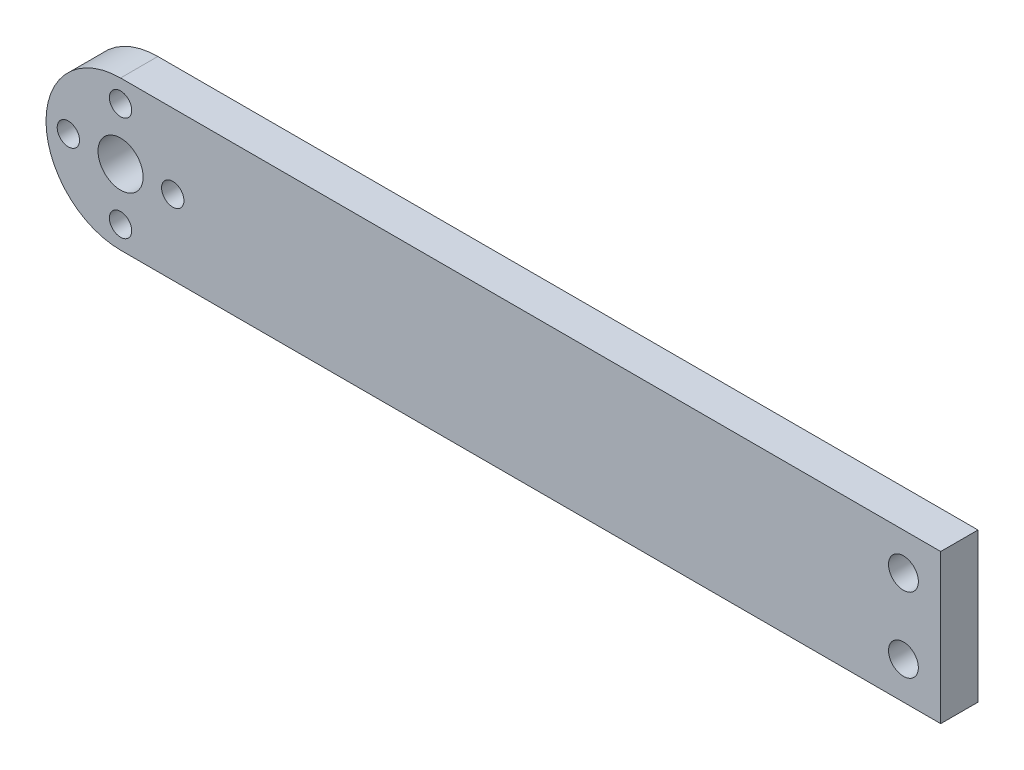
ISO-10303-21;
HEADER;
FILE_DESCRIPTION(('STEP AP214'),'2;1');
FILE_NAME('part.step','',(''),(''),'','','');
FILE_SCHEMA(('AUTOMOTIVE_DESIGN { 1 0 10303 214 1 1 1 1 }'));
ENDSEC;
DATA;
#1=APPLICATION_CONTEXT('core data for automotive mechanical design processes');
#2=APPLICATION_PROTOCOL_DEFINITION('international standard','automotive_design',2000,#1);
#3=PRODUCT_CONTEXT('',#1,'mechanical');
#4=PRODUCT('Part','Part','',(#3));
#5=PRODUCT_RELATED_PRODUCT_CATEGORY('part','',(#4));
#6=PRODUCT_DEFINITION_FORMATION('','',#4);
#7=PRODUCT_DEFINITION_CONTEXT('part definition',#1,'design');
#8=PRODUCT_DEFINITION('design','',#6,#7);
#9=PRODUCT_DEFINITION_SHAPE('','',#8);
#10=(LENGTH_UNIT() NAMED_UNIT(*) SI_UNIT(.MILLI.,.METRE.));
#11=(NAMED_UNIT(*) PLANE_ANGLE_UNIT() SI_UNIT($,.RADIAN.));
#12=(NAMED_UNIT(*) SI_UNIT($,.STERADIAN.) SOLID_ANGLE_UNIT());
#13=UNCERTAINTY_MEASURE_WITH_UNIT(LENGTH_MEASURE(1.E-05),#10,'distance_accuracy_value','');
#14=(GEOMETRIC_REPRESENTATION_CONTEXT(3) GLOBAL_UNCERTAINTY_ASSIGNED_CONTEXT((#13)) GLOBAL_UNIT_ASSIGNED_CONTEXT((#10,
#11,#12)) REPRESENTATION_CONTEXT('',''));
#15=CARTESIAN_POINT('',(0.,0.,0.));
#16=DIRECTION('',(0.,0.,1.));
#17=DIRECTION('',(1.,0.,0.));
#18=AXIS2_PLACEMENT_3D('',#15,#16,#17);
#19=CARTESIAN_POINT('',(0.,20.,5.));
#20=DIRECTION('',(0.,-1.,0.));
#21=DIRECTION('',(0.,0.,-1.));
#22=AXIS2_PLACEMENT_3D('',#19,#20,#21);
#23=PLANE('',#22);
#24=DIRECTION('',(0.,0.,1.));
#25=VECTOR('',#24,1.);
#26=CARTESIAN_POINT('',(10.,20.,-5.));
#27=LINE('',#26,#25);
#28=CARTESIAN_POINT('',(10.,20.,0.));
#29=VERTEX_POINT('',#28);
#30=CARTESIAN_POINT('',(10.,20.,5.));
#31=VERTEX_POINT('',#30);
#32=EDGE_CURVE('E85',#29,#31,#27,.T.);
#33=ORIENTED_EDGE('',*,*,#32,.T.);
#34=DIRECTION('',(-1.,0.,0.));
#35=VECTOR('',#34,1.);
#36=CARTESIAN_POINT('',(0.,20.,5.));
#37=LINE('',#36,#35);
#38=CARTESIAN_POINT('',(120.,20.,5.));
#39=VERTEX_POINT('',#38);
#40=EDGE_CURVE('E90',#39,#31,#37,.T.);
#41=ORIENTED_EDGE('',*,*,#40,.F.);
#42=DIRECTION('',(0.,0.,-1.));
#43=VECTOR('',#42,1.);
#44=CARTESIAN_POINT('',(120.,20.,5.));
#45=LINE('',#44,#43);
#46=CARTESIAN_POINT('',(120.,20.,0.));
#47=VERTEX_POINT('',#46);
#48=EDGE_CURVE('E104',#39,#47,#45,.T.);
#49=ORIENTED_EDGE('',*,*,#48,.T.);
#50=DIRECTION('',(-1.,0.,0.));
#51=VECTOR('',#50,1.);
#52=CARTESIAN_POINT('',(0.,20.,0.));
#53=LINE('',#52,#51);
#54=EDGE_CURVE('E93',#47,#29,#53,.T.);
#55=ORIENTED_EDGE('',*,*,#54,.T.);
#56=EDGE_LOOP('',(#33,#41,#49,#55));
#57=FACE_BOUND('',#56,.T.);
#58=ADVANCED_FACE('F33',(#57),#23,.F.);
#59=CARTESIAN_POINT('',(0.,0.,5.));
#60=DIRECTION('',(0.,0.,-1.));
#61=DIRECTION('',(-1.,0.,0.));
#62=AXIS2_PLACEMENT_3D('',#59,#60,#61);
#63=PLANE('',#62);
#64=CARTESIAN_POINT('',(115.,5.,5.));
#65=DIRECTION('',(0.,0.,1.));
#66=DIRECTION('',(1.,0.,0.));
#67=AXIS2_PLACEMENT_3D('',#64,#65,#66);
#68=CIRCLE('',#67,2.);
#69=CARTESIAN_POINT('',(117.,5.,5.));
#70=VERTEX_POINT('',#69);
#71=EDGE_CURVE('E134',#70,#70,#68,.T.);
#72=ORIENTED_EDGE('',*,*,#71,.F.);
#73=EDGE_LOOP('',(#72));
#74=FACE_BOUND('',#73,.T.);
#75=CARTESIAN_POINT('',(115.,15.,5.));
#76=DIRECTION('',(0.,0.,1.));
#77=DIRECTION('',(1.,0.,0.));
#78=AXIS2_PLACEMENT_3D('',#75,#76,#77);
#79=CIRCLE('',#78,2.);
#80=CARTESIAN_POINT('',(117.,15.,5.));
#81=VERTEX_POINT('',#80);
#82=EDGE_CURVE('E126',#81,#81,#79,.T.);
#83=ORIENTED_EDGE('',*,*,#82,.F.);
#84=EDGE_LOOP('',(#83));
#85=FACE_BOUND('',#84,.T.);
#86=CARTESIAN_POINT('',(10.,3.,5.));
#87=DIRECTION('',(0.,0.,1.));
#88=DIRECTION('',(1.,0.,0.));
#89=AXIS2_PLACEMENT_3D('',#86,#87,#88);
#90=CIRCLE('',#89,1.5);
#91=CARTESIAN_POINT('',(11.5,3.,5.));
#92=VERTEX_POINT('',#91);
#93=EDGE_CURVE('E137',#92,#92,#90,.T.);
#94=ORIENTED_EDGE('',*,*,#93,.F.);
#95=EDGE_LOOP('',(#94));
#96=FACE_BOUND('',#95,.T.);
#97=CARTESIAN_POINT('',(17.,10.,5.));
#98=DIRECTION('',(0.,0.,1.));
#99=DIRECTION('',(1.,0.,0.));
#100=AXIS2_PLACEMENT_3D('',#97,#98,#99);
#101=CIRCLE('',#100,1.5);
#102=CARTESIAN_POINT('',(18.5,10.,5.));
#103=VERTEX_POINT('',#102);
#104=EDGE_CURVE('E139',#103,#103,#101,.T.);
#105=ORIENTED_EDGE('',*,*,#104,.F.);
#106=EDGE_LOOP('',(#105));
#107=FACE_BOUND('',#106,.T.);
#108=CARTESIAN_POINT('',(10.,10.,5.));
#109=DIRECTION('',(0.,0.,1.));
#110=DIRECTION('',(1.,0.,0.));
#111=AXIS2_PLACEMENT_3D('',#108,#109,#110);
#112=CIRCLE('',#111,3.025);
#113=CARTESIAN_POINT('',(13.025,10.,5.));
#114=VERTEX_POINT('',#113);
#115=EDGE_CURVE('E142',#114,#114,#112,.T.);
#116=ORIENTED_EDGE('',*,*,#115,.F.);
#117=EDGE_LOOP('',(#116));
#118=FACE_BOUND('',#117,.T.);
#119=CARTESIAN_POINT('',(3.,10.,5.));
#120=DIRECTION('',(0.,0.,1.));
#121=DIRECTION('',(1.,0.,0.));
#122=AXIS2_PLACEMENT_3D('',#119,#120,#121);
#123=CIRCLE('',#122,1.5);
#124=CARTESIAN_POINT('',(4.5,10.,5.));
#125=VERTEX_POINT('',#124);
#126=EDGE_CURVE('E117',#125,#125,#123,.T.);
#127=ORIENTED_EDGE('',*,*,#126,.F.);
#128=EDGE_LOOP('',(#127));
#129=FACE_BOUND('',#128,.T.);
#130=CARTESIAN_POINT('',(10.,17.,5.));
#131=DIRECTION('',(0.,0.,1.));
#132=DIRECTION('',(1.,0.,0.));
#133=AXIS2_PLACEMENT_3D('',#130,#131,#132);
#134=CIRCLE('',#133,1.5);
#135=CARTESIAN_POINT('',(11.5,17.,5.));
#136=VERTEX_POINT('',#135);
#137=EDGE_CURVE('E100',#136,#136,#134,.T.);
#138=ORIENTED_EDGE('',*,*,#137,.F.);
#139=EDGE_LOOP('',(#138));
#140=FACE_BOUND('',#139,.T.);
#141=ORIENTED_EDGE('',*,*,#40,.T.);
#142=CARTESIAN_POINT('',(10.,10.,5.));
#143=DIRECTION('',(0.,0.,-1.));
#144=DIRECTION('',(1.,0.,0.));
#145=AXIS2_PLACEMENT_3D('',#142,#143,#144);
#146=CIRCLE('',#145,10.);
#147=CARTESIAN_POINT('',(10.,0.,5.));
#148=VERTEX_POINT('',#147);
#149=EDGE_CURVE('E82',#148,#31,#146,.T.);
#150=ORIENTED_EDGE('',*,*,#149,.F.);
#151=DIRECTION('',(1.,0.,0.));
#152=VECTOR('',#151,1.);
#153=CARTESIAN_POINT('',(0.,0.,5.));
#154=LINE('',#153,#152);
#155=CARTESIAN_POINT('',(120.,0.,5.));
#156=VERTEX_POINT('',#155);
#157=EDGE_CURVE('E88',#148,#156,#154,.T.);
#158=ORIENTED_EDGE('',*,*,#157,.T.);
#159=DIRECTION('',(0.,1.,0.));
#160=VECTOR('',#159,1.);
#161=CARTESIAN_POINT('',(120.,0.,5.));
#162=LINE('',#161,#160);
#163=EDGE_CURVE('E52',#156,#39,#162,.T.);
#164=ORIENTED_EDGE('',*,*,#163,.T.);
#165=EDGE_LOOP('',(#141,#150,#158,#164));
#166=FACE_BOUND('',#165,.T.);
#167=ADVANCED_FACE('F87',(#74,#85,#96,#107,#118,#129,#140,#166),#63,.F.);
#168=CARTESIAN_POINT('',(0.,0.,0.));
#169=DIRECTION('',(0.,0.,-1.));
#170=DIRECTION('',(-1.,0.,0.));
#171=AXIS2_PLACEMENT_3D('',#168,#169,#170);
#172=PLANE('',#171);
#173=CARTESIAN_POINT('',(115.,5.,0.));
#174=DIRECTION('',(0.,0.,-1.));
#175=DIRECTION('',(-1.,0.,0.));
#176=AXIS2_PLACEMENT_3D('',#173,#174,#175);
#177=CIRCLE('',#176,2.);
#178=CARTESIAN_POINT('',(113.,5.,0.));
#179=VERTEX_POINT('',#178);
#180=EDGE_CURVE('E37',#179,#179,#177,.T.);
#181=ORIENTED_EDGE('',*,*,#180,.F.);
#182=EDGE_LOOP('',(#181));
#183=FACE_BOUND('',#182,.T.);
#184=CARTESIAN_POINT('',(115.,15.,0.));
#185=DIRECTION('',(0.,0.,-1.));
#186=DIRECTION('',(-1.,0.,0.));
#187=AXIS2_PLACEMENT_3D('',#184,#185,#186);
#188=CIRCLE('',#187,2.);
#189=CARTESIAN_POINT('',(113.,15.,0.));
#190=VERTEX_POINT('',#189);
#191=EDGE_CURVE('E91',#190,#190,#188,.T.);
#192=ORIENTED_EDGE('',*,*,#191,.F.);
#193=EDGE_LOOP('',(#192));
#194=FACE_BOUND('',#193,.T.);
#195=CARTESIAN_POINT('',(10.,3.,0.));
#196=DIRECTION('',(0.,0.,-1.));
#197=DIRECTION('',(-1.,0.,0.));
#198=AXIS2_PLACEMENT_3D('',#195,#196,#197);
#199=CIRCLE('',#198,1.5);
#200=CARTESIAN_POINT('',(8.5,3.,0.));
#201=VERTEX_POINT('',#200);
#202=EDGE_CURVE('E123',#201,#201,#199,.T.);
#203=ORIENTED_EDGE('',*,*,#202,.F.);
#204=EDGE_LOOP('',(#203));
#205=FACE_BOUND('',#204,.T.);
#206=CARTESIAN_POINT('',(17.,10.,0.));
#207=DIRECTION('',(0.,0.,-1.));
#208=DIRECTION('',(-1.,0.,0.));
#209=AXIS2_PLACEMENT_3D('',#206,#207,#208);
#210=CIRCLE('',#209,1.5);
#211=CARTESIAN_POINT('',(15.5,10.,0.));
#212=VERTEX_POINT('',#211);
#213=EDGE_CURVE('E120',#212,#212,#210,.T.);
#214=ORIENTED_EDGE('',*,*,#213,.F.);
#215=EDGE_LOOP('',(#214));
#216=FACE_BOUND('',#215,.T.);
#217=CARTESIAN_POINT('',(10.,10.,0.));
#218=DIRECTION('',(0.,0.,-1.));
#219=DIRECTION('',(-1.,0.,0.));
#220=AXIS2_PLACEMENT_3D('',#217,#218,#219);
#221=CIRCLE('',#220,3.025);
#222=CARTESIAN_POINT('',(6.975,10.,0.));
#223=VERTEX_POINT('',#222);
#224=EDGE_CURVE('E116',#223,#223,#221,.T.);
#225=ORIENTED_EDGE('',*,*,#224,.F.);
#226=EDGE_LOOP('',(#225));
#227=FACE_BOUND('',#226,.T.);
#228=CARTESIAN_POINT('',(3.,10.,0.));
#229=DIRECTION('',(0.,0.,-1.));
#230=DIRECTION('',(-1.,0.,0.));
#231=AXIS2_PLACEMENT_3D('',#228,#229,#230);
#232=CIRCLE('',#231,1.5);
#233=CARTESIAN_POINT('',(1.5,10.,0.));
#234=VERTEX_POINT('',#233);
#235=EDGE_CURVE('E113',#234,#234,#232,.T.);
#236=ORIENTED_EDGE('',*,*,#235,.F.);
#237=EDGE_LOOP('',(#236));
#238=FACE_BOUND('',#237,.T.);
#239=CARTESIAN_POINT('',(10.,17.,0.));
#240=DIRECTION('',(0.,0.,-1.));
#241=DIRECTION('',(-1.,0.,0.));
#242=AXIS2_PLACEMENT_3D('',#239,#240,#241);
#243=CIRCLE('',#242,1.5);
#244=CARTESIAN_POINT('',(8.5,17.,0.));
#245=VERTEX_POINT('',#244);
#246=EDGE_CURVE('E106',#245,#245,#243,.T.);
#247=ORIENTED_EDGE('',*,*,#246,.F.);
#248=EDGE_LOOP('',(#247));
#249=FACE_BOUND('',#248,.T.);
#250=CARTESIAN_POINT('',(10.,10.,0.));
#251=DIRECTION('',(0.,0.,-1.));
#252=DIRECTION('',(-1.,0.,0.));
#253=AXIS2_PLACEMENT_3D('',#250,#251,#252);
#254=CIRCLE('',#253,10.);
#255=CARTESIAN_POINT('',(10.,0.,0.));
#256=VERTEX_POINT('',#255);
#257=EDGE_CURVE('E11',#29,#256,#254,.F.);
#258=ORIENTED_EDGE('',*,*,#257,.F.);
#259=ORIENTED_EDGE('',*,*,#54,.F.);
#260=DIRECTION('',(0.,1.,0.));
#261=VECTOR('',#260,1.);
#262=CARTESIAN_POINT('',(120.,0.,0.));
#263=LINE('',#262,#261);
#264=CARTESIAN_POINT('',(120.,0.,0.));
#265=VERTEX_POINT('',#264);
#266=EDGE_CURVE('E97',#265,#47,#263,.T.);
#267=ORIENTED_EDGE('',*,*,#266,.F.);
#268=DIRECTION('',(1.,0.,0.));
#269=VECTOR('',#268,1.);
#270=CARTESIAN_POINT('',(0.,0.,0.));
#271=LINE('',#270,#269);
#272=EDGE_CURVE('E63',#256,#265,#271,.T.);
#273=ORIENTED_EDGE('',*,*,#272,.F.);
#274=EDGE_LOOP('',(#258,#259,#267,#273));
#275=FACE_BOUND('',#274,.T.);
#276=ADVANCED_FACE('F153',(#183,#194,#205,#216,#227,#238,#249,#275),#172,.T.);
#277=CARTESIAN_POINT('',(0.,0.,5.));
#278=DIRECTION('',(0.,1.,0.));
#279=DIRECTION('',(0.,0.,1.));
#280=AXIS2_PLACEMENT_3D('',#277,#278,#279);
#281=PLANE('',#280);
#282=ORIENTED_EDGE('',*,*,#157,.F.);
#283=DIRECTION('',(0.,0.,1.));
#284=VECTOR('',#283,1.);
#285=CARTESIAN_POINT('',(10.,0.,-5.));
#286=LINE('',#285,#284);
#287=EDGE_CURVE('E79',#256,#148,#286,.T.);
#288=ORIENTED_EDGE('',*,*,#287,.F.);
#289=ORIENTED_EDGE('',*,*,#272,.T.);
#290=DIRECTION('',(0.,0.,-1.));
#291=VECTOR('',#290,1.);
#292=CARTESIAN_POINT('',(120.,0.,5.));
#293=LINE('',#292,#291);
#294=EDGE_CURVE('E43',#156,#265,#293,.T.);
#295=ORIENTED_EDGE('',*,*,#294,.F.);
#296=EDGE_LOOP('',(#282,#288,#289,#295));
#297=FACE_BOUND('',#296,.T.);
#298=ADVANCED_FACE('F35',(#297),#281,.F.);
#299=CARTESIAN_POINT('',(120.,0.,5.));
#300=DIRECTION('',(-1.,0.,0.));
#301=DIRECTION('',(0.,0.,1.));
#302=AXIS2_PLACEMENT_3D('',#299,#300,#301);
#303=PLANE('',#302);
#304=ORIENTED_EDGE('',*,*,#266,.T.);
#305=ORIENTED_EDGE('',*,*,#48,.F.);
#306=ORIENTED_EDGE('',*,*,#163,.F.);
#307=ORIENTED_EDGE('',*,*,#294,.T.);
#308=EDGE_LOOP('',(#304,#305,#306,#307));
#309=FACE_BOUND('',#308,.T.);
#310=ADVANCED_FACE('F164',(#309),#303,.F.);
#311=CARTESIAN_POINT('',(10.,17.,-5.));
#312=DIRECTION('',(0.,0.,1.));
#313=DIRECTION('',(1.,0.,0.));
#314=AXIS2_PLACEMENT_3D('',#311,#312,#313);
#315=CYLINDRICAL_SURFACE('',#314,1.5);
#316=ORIENTED_EDGE('',*,*,#246,.T.);
#317=EDGE_LOOP('',(#316));
#318=FACE_BOUND('',#317,.T.);
#319=ORIENTED_EDGE('',*,*,#137,.T.);
#320=EDGE_LOOP('',(#319));
#321=FACE_BOUND('',#320,.T.);
#322=ADVANCED_FACE('F161',(#318,#321),#315,.F.);
#323=CARTESIAN_POINT('',(3.,10.,-5.));
#324=DIRECTION('',(0.,0.,1.));
#325=DIRECTION('',(1.,0.,0.));
#326=AXIS2_PLACEMENT_3D('',#323,#324,#325);
#327=CYLINDRICAL_SURFACE('',#326,1.5);
#328=ORIENTED_EDGE('',*,*,#235,.T.);
#329=EDGE_LOOP('',(#328));
#330=FACE_BOUND('',#329,.T.);
#331=ORIENTED_EDGE('',*,*,#126,.T.);
#332=EDGE_LOOP('',(#331));
#333=FACE_BOUND('',#332,.T.);
#334=ADVANCED_FACE('F163',(#330,#333),#327,.F.);
#335=CARTESIAN_POINT('',(10.,10.,-5.));
#336=DIRECTION('',(0.,0.,1.));
#337=DIRECTION('',(1.,0.,0.));
#338=AXIS2_PLACEMENT_3D('',#335,#336,#337);
#339=CYLINDRICAL_SURFACE('',#338,3.025);
#340=ORIENTED_EDGE('',*,*,#224,.T.);
#341=EDGE_LOOP('',(#340));
#342=FACE_BOUND('',#341,.T.);
#343=ORIENTED_EDGE('',*,*,#115,.T.);
#344=EDGE_LOOP('',(#343));
#345=FACE_BOUND('',#344,.T.);
#346=ADVANCED_FACE('F149',(#342,#345),#339,.F.);
#347=CARTESIAN_POINT('',(17.,10.,-5.));
#348=DIRECTION('',(0.,0.,1.));
#349=DIRECTION('',(1.,0.,0.));
#350=AXIS2_PLACEMENT_3D('',#347,#348,#349);
#351=CYLINDRICAL_SURFACE('',#350,1.5);
#352=ORIENTED_EDGE('',*,*,#213,.T.);
#353=EDGE_LOOP('',(#352));
#354=FACE_BOUND('',#353,.T.);
#355=ORIENTED_EDGE('',*,*,#104,.T.);
#356=EDGE_LOOP('',(#355));
#357=FACE_BOUND('',#356,.T.);
#358=ADVANCED_FACE('F201',(#354,#357),#351,.F.);
#359=CARTESIAN_POINT('',(10.,3.,-5.));
#360=DIRECTION('',(0.,0.,1.));
#361=DIRECTION('',(1.,0.,0.));
#362=AXIS2_PLACEMENT_3D('',#359,#360,#361);
#363=CYLINDRICAL_SURFACE('',#362,1.5);
#364=ORIENTED_EDGE('',*,*,#202,.T.);
#365=EDGE_LOOP('',(#364));
#366=FACE_BOUND('',#365,.T.);
#367=ORIENTED_EDGE('',*,*,#93,.T.);
#368=EDGE_LOOP('',(#367));
#369=FACE_BOUND('',#368,.T.);
#370=ADVANCED_FACE('F205',(#366,#369),#363,.F.);
#371=CARTESIAN_POINT('',(10.,10.,-5.));
#372=DIRECTION('',(0.,0.,1.));
#373=DIRECTION('',(1.,0.,0.));
#374=AXIS2_PLACEMENT_3D('',#371,#372,#373);
#375=CYLINDRICAL_SURFACE('',#374,10.);
#376=ORIENTED_EDGE('',*,*,#149,.T.);
#377=ORIENTED_EDGE('',*,*,#32,.F.);
#378=ORIENTED_EDGE('',*,*,#257,.T.);
#379=ORIENTED_EDGE('',*,*,#287,.T.);
#380=EDGE_LOOP('',(#376,#377,#378,#379));
#381=FACE_BOUND('',#380,.T.);
#382=ADVANCED_FACE('F81',(#381),#375,.T.);
#383=CARTESIAN_POINT('',(115.,15.,-5.));
#384=DIRECTION('',(0.,0.,1.));
#385=DIRECTION('',(1.,0.,0.));
#386=AXIS2_PLACEMENT_3D('',#383,#384,#385);
#387=CYLINDRICAL_SURFACE('',#386,2.);
#388=ORIENTED_EDGE('',*,*,#191,.T.);
#389=EDGE_LOOP('',(#388));
#390=FACE_BOUND('',#389,.T.);
#391=ORIENTED_EDGE('',*,*,#82,.T.);
#392=EDGE_LOOP('',(#391));
#393=FACE_BOUND('',#392,.T.);
#394=ADVANCED_FACE('F214',(#390,#393),#387,.F.);
#395=CARTESIAN_POINT('',(115.,5.,-5.));
#396=DIRECTION('',(0.,0.,1.));
#397=DIRECTION('',(1.,0.,0.));
#398=AXIS2_PLACEMENT_3D('',#395,#396,#397);
#399=CYLINDRICAL_SURFACE('',#398,2.);
#400=ORIENTED_EDGE('',*,*,#180,.T.);
#401=EDGE_LOOP('',(#400));
#402=FACE_BOUND('',#401,.T.);
#403=ORIENTED_EDGE('',*,*,#71,.T.);
#404=EDGE_LOOP('',(#403));
#405=FACE_BOUND('',#404,.T.);
#406=ADVANCED_FACE('F217',(#402,#405),#399,.F.);
#407=CLOSED_SHELL('',(#58,#167,#276,#298,#310,#322,#334,#346,#358,#370,#382,#394,#406));
#408=MANIFOLD_SOLID_BREP('B2',#407);
#409=ADVANCED_BREP_SHAPE_REPRESENTATION('',(#18,#408),#14);
#410=SHAPE_DEFINITION_REPRESENTATION(#9,#409);
ENDSEC;
END-ISO-10303-21;
